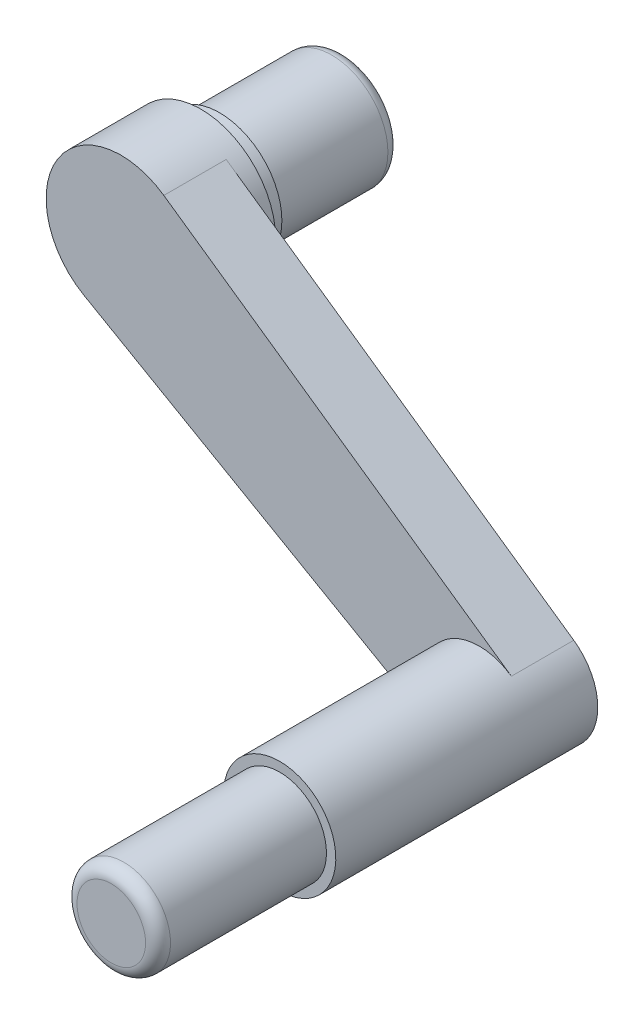
ISO-10303-21;
HEADER;
FILE_DESCRIPTION(('STEP AP214'),'2;1');
FILE_NAME('part.step','',(''),(''),'','','');
FILE_SCHEMA(('AUTOMOTIVE_DESIGN { 1 0 10303 214 1 1 1 1 }'));
ENDSEC;
DATA;
#1=APPLICATION_CONTEXT('core data for automotive mechanical design processes');
#2=APPLICATION_PROTOCOL_DEFINITION('international standard','automotive_design',2000,#1);
#3=PRODUCT_CONTEXT('',#1,'mechanical');
#4=PRODUCT('Part','Part','',(#3));
#5=PRODUCT_RELATED_PRODUCT_CATEGORY('part','',(#4));
#6=PRODUCT_DEFINITION_FORMATION('','',#4);
#7=PRODUCT_DEFINITION_CONTEXT('part definition',#1,'design');
#8=PRODUCT_DEFINITION('design','',#6,#7);
#9=PRODUCT_DEFINITION_SHAPE('','',#8);
#10=(LENGTH_UNIT() NAMED_UNIT(*) SI_UNIT(.MILLI.,.METRE.));
#11=(NAMED_UNIT(*) PLANE_ANGLE_UNIT() SI_UNIT($,.RADIAN.));
#12=(NAMED_UNIT(*) SI_UNIT($,.STERADIAN.) SOLID_ANGLE_UNIT());
#13=UNCERTAINTY_MEASURE_WITH_UNIT(LENGTH_MEASURE(1.E-05),#10,'distance_accuracy_value','');
#14=(GEOMETRIC_REPRESENTATION_CONTEXT(3) GLOBAL_UNCERTAINTY_ASSIGNED_CONTEXT((#13)) GLOBAL_UNIT_ASSIGNED_CONTEXT((#10,
#11,#12)) REPRESENTATION_CONTEXT('',''));
#15=CARTESIAN_POINT('',(0.,0.,0.));
#16=DIRECTION('',(0.,0.,1.));
#17=DIRECTION('',(1.,0.,0.));
#18=AXIS2_PLACEMENT_3D('',#15,#16,#17);
#19=CARTESIAN_POINT('',(0.,0.,55.5808024828198));
#20=DIRECTION('',(0.,0.,1.));
#21=DIRECTION('',(1.,0.,0.));
#22=AXIS2_PLACEMENT_3D('',#19,#20,#21);
#23=CYLINDRICAL_SURFACE('',#22,60.);
#24=CARTESIAN_POINT('',(0.,0.,-64.));
#25=DIRECTION('',(0.,0.,1.));
#26=DIRECTION('',(1.,0.,0.));
#27=AXIS2_PLACEMENT_3D('',#24,#25,#26);
#28=CIRCLE('',#27,60.);
#29=CARTESIAN_POINT('',(60.,0.,-64.));
#30=VERTEX_POINT('',#29);
#31=EDGE_CURVE('E123',#30,#30,#28,.T.);
#32=ORIENTED_EDGE('',*,*,#31,.T.);
#33=EDGE_LOOP('',(#32));
#34=FACE_BOUND('',#33,.T.);
#35=DIRECTION('',(0.,0.,1.));
#36=VECTOR('',#35,1.);
#37=CARTESIAN_POINT('',(34.3449427528087,49.1978140500805,-50.));
#38=LINE('',#37,#36);
#39=CARTESIAN_POINT('',(34.3449427528087,49.1978140500805,-50.));
#40=VERTEX_POINT('',#39);
#41=CARTESIAN_POINT('',(34.3449427528087,49.1978140500805,0.));
#42=VERTEX_POINT('',#41);
#43=EDGE_CURVE('E110',#40,#42,#38,.T.);
#44=ORIENTED_EDGE('',*,*,#43,.F.);
#45=CARTESIAN_POINT('',(0.,0.,-50.));
#46=DIRECTION('',(0.,0.,1.));
#47=DIRECTION('',(1.,0.,0.));
#48=AXIS2_PLACEMENT_3D('',#45,#46,#47);
#49=CIRCLE('',#48,60.);
#50=CARTESIAN_POINT('',(-29.8765166726352,-52.0326219934163,-50.));
#51=VERTEX_POINT('',#50);
#52=EDGE_CURVE('E63',#51,#40,#49,.T.);
#53=ORIENTED_EDGE('',*,*,#52,.F.);
#54=DIRECTION('',(0.,0.,1.));
#55=VECTOR('',#54,1.);
#56=CARTESIAN_POINT('',(-29.8765166726352,-52.0326219934163,-50.));
#57=LINE('',#56,#55);
#58=CARTESIAN_POINT('',(-29.8765166726352,-52.0326219934163,0.));
#59=VERTEX_POINT('',#58);
#60=EDGE_CURVE('E84',#51,#59,#57,.T.);
#61=ORIENTED_EDGE('',*,*,#60,.T.);
#62=CARTESIAN_POINT('',(0.,0.,0.));
#63=DIRECTION('',(0.,0.,1.));
#64=DIRECTION('',(1.,0.,0.));
#65=AXIS2_PLACEMENT_3D('',#62,#63,#64);
#66=CIRCLE('',#65,60.);
#67=EDGE_CURVE('E103',#42,#59,#66,.T.);
#68=ORIENTED_EDGE('',*,*,#67,.F.);
#69=EDGE_LOOP('',(#44,#53,#61,#68));
#70=FACE_BOUND('',#69,.T.);
#71=ADVANCED_FACE('F39',(#34,#70),#23,.T.);
#72=CARTESIAN_POINT('',(0.,0.,0.));
#73=DIRECTION('',(0.,0.,-1.));
#74=DIRECTION('',(-1.,0.,0.));
#75=AXIS2_PLACEMENT_3D('',#72,#73,#74);
#76=PLANE('',#75);
#77=DIRECTION('',(0.867210366556939,-0.497941944543919,0.));
#78=VECTOR('',#77,1.);
#79=CARTESIAN_POINT('',(-29.8765166726352,-52.0326219934163,0.));
#80=LINE('',#79,#78);
#81=CARTESIAN_POINT('',(264.818131866536,-221.242806741187,0.));
#82=VERTEX_POINT('',#81);
#83=EDGE_CURVE('E95',#59,#82,#80,.T.);
#84=ORIENTED_EDGE('',*,*,#83,.T.);
#85=CARTESIAN_POINT('',(287.225519371012,-182.218340246125,0.));
#86=DIRECTION('',(0.,0.,-1.));
#87=DIRECTION('',(-1.,0.,0.));
#88=AXIS2_PLACEMENT_3D('',#85,#86,#87);
#89=CIRCLE('',#88,44.9999999999999);
#90=CARTESIAN_POINT('',(312.984226435618,-145.319979708564,0.));
#91=VERTEX_POINT('',#90);
#92=EDGE_CURVE('E77',#82,#91,#89,.T.);
#93=ORIENTED_EDGE('',*,*,#92,.T.);
#94=DIRECTION('',(-0.819963567501341,0.572415712546811,0.));
#95=VECTOR('',#94,1.);
#96=CARTESIAN_POINT('',(34.3449427528087,49.1978140500805,0.));
#97=LINE('',#96,#95);
#98=EDGE_CURVE('E54',#91,#42,#97,.T.);
#99=ORIENTED_EDGE('',*,*,#98,.T.);
#100=ORIENTED_EDGE('',*,*,#67,.T.);
#101=EDGE_LOOP('',(#84,#93,#99,#100));
#102=FACE_BOUND('',#101,.T.);
#103=ADVANCED_FACE('F101',(#102),#76,.F.);
#104=CARTESIAN_POINT('',(0.,50.,-64.));
#105=DIRECTION('',(0.,0.,1.));
#106=DIRECTION('',(1.,0.,0.));
#107=AXIS2_PLACEMENT_3D('',#104,#105,#106);
#108=PLANE('',#107);
#109=ORIENTED_EDGE('',*,*,#31,.F.);
#110=EDGE_LOOP('',(#109));
#111=FACE_BOUND('',#110,.T.);
#112=CARTESIAN_POINT('',(0.,0.,-64.));
#113=DIRECTION('',(0.,0.,1.));
#114=DIRECTION('',(1.,0.,0.));
#115=AXIS2_PLACEMENT_3D('',#112,#113,#114);
#116=CIRCLE('',#115,50.);
#117=CARTESIAN_POINT('',(50.,0.,-64.));
#118=VERTEX_POINT('',#117);
#119=EDGE_CURVE('E120',#118,#118,#116,.T.);
#120=ORIENTED_EDGE('',*,*,#119,.T.);
#121=EDGE_LOOP('',(#120));
#122=FACE_BOUND('',#121,.T.);
#123=ADVANCED_FACE('F155',(#111,#122),#108,.F.);
#124=CARTESIAN_POINT('',(0.,0.,55.5808024828198));
#125=DIRECTION('',(0.,0.,1.));
#126=DIRECTION('',(1.,0.,0.));
#127=AXIS2_PLACEMENT_3D('',#124,#125,#126);
#128=CYLINDRICAL_SURFACE('',#127,50.);
#129=ORIENTED_EDGE('',*,*,#119,.F.);
#130=EDGE_LOOP('',(#129));
#131=FACE_BOUND('',#130,.T.);
#132=CARTESIAN_POINT('',(0.,0.,-79.));
#133=DIRECTION('',(0.,0.,1.));
#134=DIRECTION('',(1.,0.,0.));
#135=AXIS2_PLACEMENT_3D('',#132,#133,#134);
#136=CIRCLE('',#135,50.);
#137=CARTESIAN_POINT('',(50.,0.,-79.));
#138=VERTEX_POINT('',#137);
#139=EDGE_CURVE('E117',#138,#138,#136,.T.);
#140=ORIENTED_EDGE('',*,*,#139,.T.);
#141=EDGE_LOOP('',(#140));
#142=FACE_BOUND('',#141,.T.);
#143=ADVANCED_FACE('F161',(#131,#142),#128,.T.);
#144=CARTESIAN_POINT('',(0.,50.,-79.));
#145=DIRECTION('',(0.,0.,1.));
#146=DIRECTION('',(1.,0.,0.));
#147=AXIS2_PLACEMENT_3D('',#144,#145,#146);
#148=PLANE('',#147);
#149=ORIENTED_EDGE('',*,*,#139,.F.);
#150=EDGE_LOOP('',(#149));
#151=FACE_BOUND('',#150,.T.);
#152=CARTESIAN_POINT('',(0.,0.,-79.));
#153=DIRECTION('',(0.,0.,1.));
#154=DIRECTION('',(1.,0.,0.));
#155=AXIS2_PLACEMENT_3D('',#152,#153,#154);
#156=CIRCLE('',#155,45.);
#157=CARTESIAN_POINT('',(45.,0.,-79.));
#158=VERTEX_POINT('',#157);
#159=EDGE_CURVE('E112',#158,#158,#156,.T.);
#160=ORIENTED_EDGE('',*,*,#159,.T.);
#161=EDGE_LOOP('',(#160));
#162=FACE_BOUND('',#161,.T.);
#163=ADVANCED_FACE('F165',(#151,#162),#148,.F.);
#164=CARTESIAN_POINT('',(0.,0.,55.5808024828198));
#165=DIRECTION('',(0.,0.,1.));
#166=DIRECTION('',(1.,0.,0.));
#167=AXIS2_PLACEMENT_3D('',#164,#165,#166);
#168=CYLINDRICAL_SURFACE('',#167,45.);
#169=CARTESIAN_POINT('',(0.,0.,-169.));
#170=DIRECTION('',(0.,0.,1.));
#171=DIRECTION('',(1.,0.,0.));
#172=AXIS2_PLACEMENT_3D('',#169,#170,#171);
#173=CIRCLE('',#172,45.);
#174=CARTESIAN_POINT('',(45.,0.,-169.));
#175=VERTEX_POINT('',#174);
#176=EDGE_CURVE('E47',#175,#175,#173,.T.);
#177=ORIENTED_EDGE('',*,*,#176,.T.);
#178=EDGE_LOOP('',(#177));
#179=FACE_BOUND('',#178,.T.);
#180=ORIENTED_EDGE('',*,*,#159,.F.);
#181=EDGE_LOOP('',(#180));
#182=FACE_BOUND('',#181,.T.);
#183=ADVANCED_FACE('F137',(#179,#182),#168,.T.);
#184=CARTESIAN_POINT('',(0.,45.,-179.));
#185=DIRECTION('',(0.,0.,1.));
#186=DIRECTION('',(1.,0.,0.));
#187=AXIS2_PLACEMENT_3D('',#184,#185,#186);
#188=PLANE('',#187);
#189=CARTESIAN_POINT('',(0.,0.,-179.));
#190=DIRECTION('',(0.,0.,1.));
#191=DIRECTION('',(1.,0.,0.));
#192=AXIS2_PLACEMENT_3D('',#189,#190,#191);
#193=CIRCLE('',#192,35.);
#194=CARTESIAN_POINT('',(35.,0.,-179.));
#195=VERTEX_POINT('',#194);
#196=EDGE_CURVE('E11',#195,#195,#193,.F.);
#197=ORIENTED_EDGE('',*,*,#196,.T.);
#198=EDGE_LOOP('',(#197));
#199=FACE_BOUND('',#198,.T.);
#200=ADVANCED_FACE('F172',(#199),#188,.F.);
#201=CARTESIAN_POINT('',(34.3449427528087,49.1978140500805,-50.));
#202=DIRECTION('',(0.572415712546811,0.819963567501341,0.));
#203=DIRECTION('',(-0.819963567501341,0.572415712546811,0.));
#204=AXIS2_PLACEMENT_3D('',#201,#202,#203);
#205=PLANE('',#204);
#206=ORIENTED_EDGE('',*,*,#98,.F.);
#207=DIRECTION('',(0.,0.,1.));
#208=VECTOR('',#207,1.);
#209=CARTESIAN_POINT('',(312.984226435618,-145.319979708564,-50.));
#210=LINE('',#209,#208);
#211=CARTESIAN_POINT('',(312.984226435618,-145.319979708564,-50.));
#212=VERTEX_POINT('',#211);
#213=EDGE_CURVE('E94',#212,#91,#210,.T.);
#214=ORIENTED_EDGE('',*,*,#213,.F.);
#215=DIRECTION('',(-0.819963567501341,0.572415712546811,0.));
#216=VECTOR('',#215,1.);
#217=CARTESIAN_POINT('',(34.3449427528087,49.1978140500805,-50.));
#218=LINE('',#217,#216);
#219=EDGE_CURVE('E107',#212,#40,#218,.T.);
#220=ORIENTED_EDGE('',*,*,#219,.T.);
#221=ORIENTED_EDGE('',*,*,#43,.T.);
#222=EDGE_LOOP('',(#206,#214,#220,#221));
#223=FACE_BOUND('',#222,.T.);
#224=ADVANCED_FACE('F175',(#223),#205,.T.);
#225=CARTESIAN_POINT('',(287.225519371012,-182.218340246125,-50.));
#226=DIRECTION('',(0.,0.,1.));
#227=DIRECTION('',(1.,0.,0.));
#228=AXIS2_PLACEMENT_3D('',#225,#226,#227);
#229=CYLINDRICAL_SURFACE('',#228,44.9999999999999);
#230=ORIENTED_EDGE('',*,*,#213,.T.);
#231=ORIENTED_EDGE('',*,*,#92,.F.);
#232=DIRECTION('',(0.,0.,1.));
#233=VECTOR('',#232,1.);
#234=CARTESIAN_POINT('',(264.818131866536,-221.242806741187,-50.));
#235=LINE('',#234,#233);
#236=CARTESIAN_POINT('',(264.818131866536,-221.242806741187,-50.));
#237=VERTEX_POINT('',#236);
#238=EDGE_CURVE('E92',#237,#82,#235,.T.);
#239=ORIENTED_EDGE('',*,*,#238,.F.);
#240=CARTESIAN_POINT('',(287.225519371012,-182.218340246125,-50.));
#241=DIRECTION('',(0.,0.,1.));
#242=DIRECTION('',(1.,0.,0.));
#243=AXIS2_PLACEMENT_3D('',#240,#241,#242);
#244=CIRCLE('',#243,44.9999999999999);
#245=EDGE_CURVE('E305',#237,#212,#244,.T.);
#246=ORIENTED_EDGE('',*,*,#245,.T.);
#247=EDGE_LOOP('',(#230,#231,#239,#246));
#248=FACE_BOUND('',#247,.T.);
#249=CARTESIAN_POINT('',(287.225519371012,-182.218340246125,160.));
#250=DIRECTION('',(0.,0.,-1.));
#251=DIRECTION('',(-1.,0.,0.));
#252=AXIS2_PLACEMENT_3D('',#249,#250,#251);
#253=CIRCLE('',#252,44.9999999999999);
#254=CARTESIAN_POINT('',(242.225519371012,-182.218340246125,160.));
#255=VERTEX_POINT('',#254);
#256=EDGE_CURVE('E96',#255,#255,#253,.T.);
#257=ORIENTED_EDGE('',*,*,#256,.T.);
#258=EDGE_LOOP('',(#257));
#259=FACE_BOUND('',#258,.T.);
#260=ADVANCED_FACE('F89',(#248,#259),#229,.T.);
#261=CARTESIAN_POINT('',(-29.8765166726352,-52.0326219934163,-50.));
#262=DIRECTION('',(-0.497941944543919,-0.867210366556939,0.));
#263=DIRECTION('',(0.867210366556939,-0.497941944543919,0.));
#264=AXIS2_PLACEMENT_3D('',#261,#262,#263);
#265=PLANE('',#264);
#266=ORIENTED_EDGE('',*,*,#83,.F.);
#267=ORIENTED_EDGE('',*,*,#60,.F.);
#268=DIRECTION('',(0.867210366556939,-0.497941944543919,0.));
#269=VECTOR('',#268,1.);
#270=CARTESIAN_POINT('',(-29.8765166726352,-52.0326219934163,-50.));
#271=LINE('',#270,#269);
#272=EDGE_CURVE('E99',#51,#237,#271,.T.);
#273=ORIENTED_EDGE('',*,*,#272,.T.);
#274=ORIENTED_EDGE('',*,*,#238,.T.);
#275=EDGE_LOOP('',(#266,#267,#273,#274));
#276=FACE_BOUND('',#275,.T.);
#277=ADVANCED_FACE('F98',(#276),#265,.T.);
#278=CARTESIAN_POINT('',(287.225519371012,-182.218340246125,-50.));
#279=DIRECTION('',(0.,0.,1.));
#280=DIRECTION('',(1.,0.,0.));
#281=AXIS2_PLACEMENT_3D('',#278,#279,#280);
#282=PLANE('',#281);
#283=ORIENTED_EDGE('',*,*,#219,.F.);
#284=ORIENTED_EDGE('',*,*,#245,.F.);
#285=ORIENTED_EDGE('',*,*,#272,.F.);
#286=ORIENTED_EDGE('',*,*,#52,.T.);
#287=EDGE_LOOP('',(#283,#284,#285,#286));
#288=FACE_BOUND('',#287,.T.);
#289=ADVANCED_FACE('F179',(#288),#282,.F.);
#290=CARTESIAN_POINT('',(287.225519371012,-182.218340246125,160.));
#291=DIRECTION('',(0.,0.,-1.));
#292=DIRECTION('',(-1.,0.,0.));
#293=AXIS2_PLACEMENT_3D('',#290,#291,#292);
#294=PLANE('',#293);
#295=CARTESIAN_POINT('',(287.225519371012,-182.218340246125,160.));
#296=DIRECTION('',(0.,0.,1.));
#297=DIRECTION('',(1.,0.,0.));
#298=AXIS2_PLACEMENT_3D('',#295,#296,#297);
#299=CIRCLE('',#298,37.5);
#300=CARTESIAN_POINT('',(324.725519371012,-182.218340246125,160.));
#301=VERTEX_POINT('',#300);
#302=EDGE_CURVE('E128',#301,#301,#299,.T.);
#303=ORIENTED_EDGE('',*,*,#302,.F.);
#304=EDGE_LOOP('',(#303));
#305=FACE_BOUND('',#304,.T.);
#306=ORIENTED_EDGE('',*,*,#256,.F.);
#307=EDGE_LOOP('',(#306));
#308=FACE_BOUND('',#307,.T.);
#309=ADVANCED_FACE('F187',(#305,#308),#294,.F.);
#310=CARTESIAN_POINT('',(287.225519371012,-182.218340246125,295.));
#311=DIRECTION('',(0.,0.,-1.));
#312=DIRECTION('',(-1.,0.,0.));
#313=AXIS2_PLACEMENT_3D('',#310,#311,#312);
#314=CYLINDRICAL_SURFACE('',#313,37.5);
#315=CARTESIAN_POINT('',(287.225519371012,-182.218340246125,285.));
#316=DIRECTION('',(0.,0.,1.));
#317=DIRECTION('',(1.,0.,0.));
#318=AXIS2_PLACEMENT_3D('',#315,#316,#317);
#319=CIRCLE('',#318,37.5);
#320=CARTESIAN_POINT('',(324.725519371012,-182.218340246125,285.));
#321=VERTEX_POINT('',#320);
#322=EDGE_CURVE('E132',#321,#321,#319,.F.);
#323=ORIENTED_EDGE('',*,*,#322,.T.);
#324=EDGE_LOOP('',(#323));
#325=FACE_BOUND('',#324,.T.);
#326=ORIENTED_EDGE('',*,*,#302,.T.);
#327=EDGE_LOOP('',(#326));
#328=FACE_BOUND('',#327,.T.);
#329=ADVANCED_FACE('F190',(#325,#328),#314,.T.);
#330=CARTESIAN_POINT('',(287.225519371012,-182.218340246125,295.));
#331=DIRECTION('',(0.,0.,1.));
#332=DIRECTION('',(1.,0.,0.));
#333=AXIS2_PLACEMENT_3D('',#330,#331,#332);
#334=PLANE('',#333);
#335=CARTESIAN_POINT('',(287.225519371012,-182.218340246125,295.));
#336=DIRECTION('',(0.,0.,1.));
#337=DIRECTION('',(1.,0.,0.));
#338=AXIS2_PLACEMENT_3D('',#335,#336,#337);
#339=CIRCLE('',#338,27.5);
#340=CARTESIAN_POINT('',(314.725519371012,-182.218340246125,295.));
#341=VERTEX_POINT('',#340);
#342=EDGE_CURVE('E129',#341,#341,#339,.T.);
#343=ORIENTED_EDGE('',*,*,#342,.T.);
#344=EDGE_LOOP('',(#343));
#345=FACE_BOUND('',#344,.T.);
#346=ADVANCED_FACE('F146',(#345),#334,.T.);
#347=CARTESIAN_POINT('',(287.225519371012,-182.218340246125,285.));
#348=DIRECTION('',(0.,0.,1.));
#349=DIRECTION('',(1.,0.,0.));
#350=AXIS2_PLACEMENT_3D('',#347,#348,#349);
#351=TOROIDAL_SURFACE('',#350,27.5,10.);
#352=ORIENTED_EDGE('',*,*,#322,.F.);
#353=EDGE_LOOP('',(#352));
#354=FACE_BOUND('',#353,.T.);
#355=ORIENTED_EDGE('',*,*,#342,.F.);
#356=EDGE_LOOP('',(#355));
#357=FACE_BOUND('',#356,.T.);
#358=ADVANCED_FACE('F141',(#354,#357),#351,.T.);
#359=CARTESIAN_POINT('',(0.,0.,-169.));
#360=DIRECTION('',(0.,0.,1.));
#361=DIRECTION('',(1.,0.,0.));
#362=AXIS2_PLACEMENT_3D('',#359,#360,#361);
#363=TOROIDAL_SURFACE('',#362,35.,10.);
#364=ORIENTED_EDGE('',*,*,#196,.F.);
#365=EDGE_LOOP('',(#364));
#366=FACE_BOUND('',#365,.T.);
#367=ORIENTED_EDGE('',*,*,#176,.F.);
#368=EDGE_LOOP('',(#367));
#369=FACE_BOUND('',#368,.T.);
#370=ADVANCED_FACE('F41',(#366,#369),#363,.T.);
#371=CLOSED_SHELL('',(#71,#103,#123,#143,#163,#183,#200,#224,#260,#277,#289,#309,#329,#346,#358,#370));
#372=MANIFOLD_SOLID_BREP('B2',#371);
#373=ADVANCED_BREP_SHAPE_REPRESENTATION('',(#18,#372),#14);
#374=SHAPE_DEFINITION_REPRESENTATION(#9,#373);
ENDSEC;
END-ISO-10303-21;
